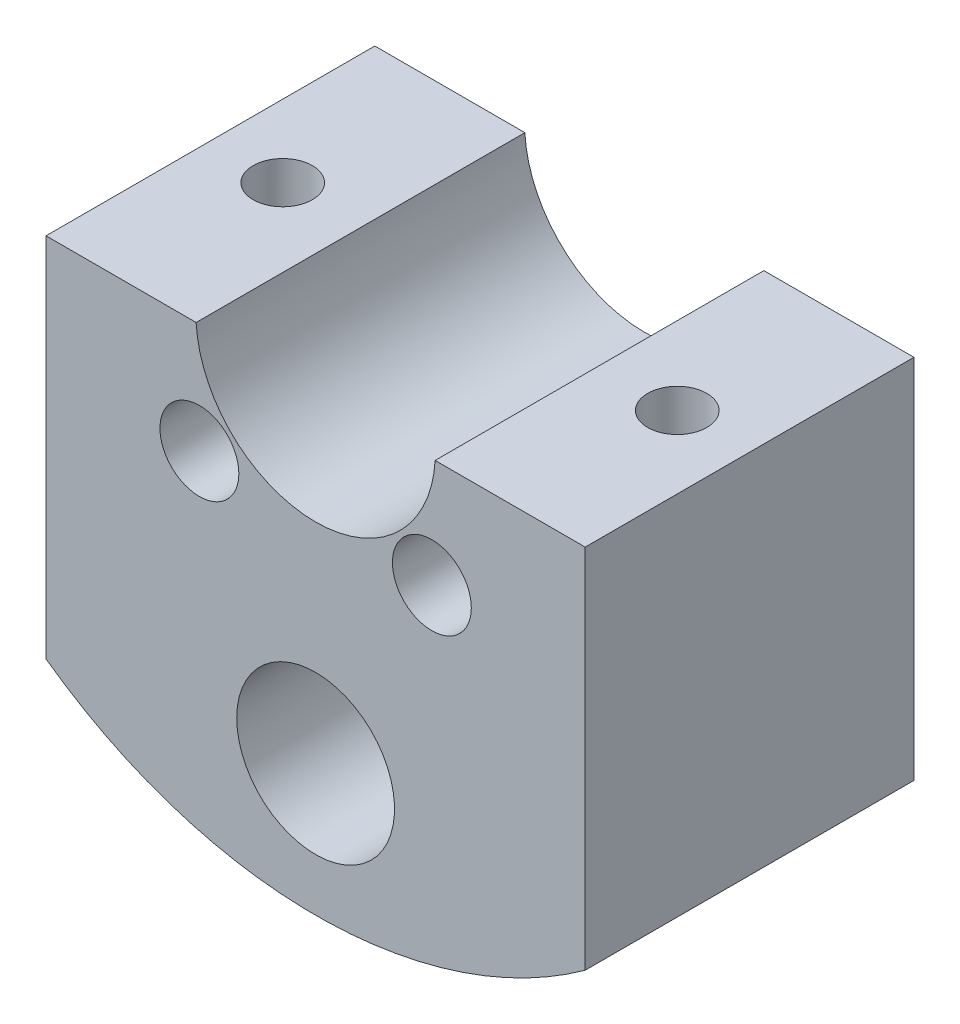
ISO-10303-21;
HEADER;
FILE_DESCRIPTION(('STEP AP214'),'2;1');
FILE_NAME('part.step','',(''),(''),'','','');
FILE_SCHEMA(('AUTOMOTIVE_DESIGN { 1 0 10303 214 1 1 1 1 }'));
ENDSEC;
DATA;
#1=APPLICATION_CONTEXT('core data for automotive mechanical design processes');
#2=APPLICATION_PROTOCOL_DEFINITION('international standard','automotive_design',2000,#1);
#3=PRODUCT_CONTEXT('',#1,'mechanical');
#4=PRODUCT('Part','Part','',(#3));
#5=PRODUCT_RELATED_PRODUCT_CATEGORY('part','',(#4));
#6=PRODUCT_DEFINITION_FORMATION('','',#4);
#7=PRODUCT_DEFINITION_CONTEXT('part definition',#1,'design');
#8=PRODUCT_DEFINITION('design','',#6,#7);
#9=PRODUCT_DEFINITION_SHAPE('','',#8);
#10=(LENGTH_UNIT() NAMED_UNIT(*) SI_UNIT(.MILLI.,.METRE.));
#11=(NAMED_UNIT(*) PLANE_ANGLE_UNIT() SI_UNIT($,.RADIAN.));
#12=(NAMED_UNIT(*) SI_UNIT($,.STERADIAN.) SOLID_ANGLE_UNIT());
#13=UNCERTAINTY_MEASURE_WITH_UNIT(LENGTH_MEASURE(1.E-05),#10,'distance_accuracy_value','');
#14=(GEOMETRIC_REPRESENTATION_CONTEXT(3) GLOBAL_UNCERTAINTY_ASSIGNED_CONTEXT((#13)) GLOBAL_UNIT_ASSIGNED_CONTEXT((#10,
#11,#12)) REPRESENTATION_CONTEXT('',''));
#15=CARTESIAN_POINT('',(0.,0.,0.));
#16=DIRECTION('',(0.,0.,1.));
#17=DIRECTION('',(1.,0.,0.));
#18=AXIS2_PLACEMENT_3D('',#15,#16,#17);
#19=CARTESIAN_POINT('',(0.,0.,-5.));
#20=DIRECTION('',(0.,0.,1.));
#21=DIRECTION('',(-1.,0.,0.));
#22=AXIS2_PLACEMENT_3D('',#19,#20,#21);
#23=CYLINDRICAL_SURFACE('',#22,35.);
#24=CARTESIAN_POINT('',(-15.,-31.6227766016838,-22.5));
#25=CARTESIAN_POINT('',(-14.7108595892664,-31.7599250587008,-22.499984811224));
#26=CARTESIAN_POINT('',(-14.4197303799188,-31.8931117339959,-22.4748546724919));
#27=CARTESIAN_POINT('',(-13.986388899209,-32.0843593115852,-22.3983865453481));
#28=CARTESIAN_POINT('',(-13.8424412778676,-32.1467105918036,-22.3664136376734));
#29=CARTESIAN_POINT('',(-13.5567255642703,-32.2682384217534,-22.289448152427));
#30=CARTESIAN_POINT('',(-13.4149566136927,-32.3274162458475,-22.2444608481555));
#31=CARTESIAN_POINT('',(-13.1341769045251,-32.4425112670565,-22.1412474885781));
#32=CARTESIAN_POINT('',(-12.9951803260907,-32.4984136353401,-22.0829663151793));
#33=CARTESIAN_POINT('',(-12.7218824991287,-32.606368674814,-21.9534294909495));
#34=CARTESIAN_POINT('',(-12.5875792807361,-32.6584229715763,-21.8821793632505));
#35=CARTESIAN_POINT('',(-12.3249178695441,-32.7584516548658,-21.7269619860706));
#36=CARTESIAN_POINT('',(-12.1965598959624,-32.8064258910043,-21.6429942681433));
#37=CARTESIAN_POINT('',(-11.9471326156375,-32.8980801333622,-21.4627853120111));
#38=CARTESIAN_POINT('',(-11.8260627732047,-32.9417604553412,-21.3665449774889));
#39=CARTESIAN_POINT('',(-11.6006146265409,-33.0217965909881,-21.1694715157018));
#40=CARTESIAN_POINT('',(-11.4956610263076,-33.058450061223,-21.0694166493023));
#41=CARTESIAN_POINT('',(-11.294247667538,-33.1278027540744,-20.859838964217));
#42=CARTESIAN_POINT('',(-11.1977872850142,-33.1605022672498,-20.7503168422538));
#43=CARTESIAN_POINT('',(-11.0143610271354,-33.2218784340844,-20.5225904653614));
#44=CARTESIAN_POINT('',(-10.927392577604,-33.2505561790362,-20.4043885789708));
#45=CARTESIAN_POINT('',(-10.7638261117773,-33.3038654003796,-20.1601557089798));
#46=CARTESIAN_POINT('',(-10.687227648019,-33.3284970513694,-20.0341250635316));
#47=CARTESIAN_POINT('',(-10.5495800038547,-33.3723126998023,-19.7831918141219));
#48=CARTESIAN_POINT('',(-10.4878642616025,-33.391738563085,-19.6586965043673));
#49=CARTESIAN_POINT('',(-10.3748379660337,-33.4270286791021,-19.404527513593));
#50=CARTESIAN_POINT('',(-10.3235308951628,-33.4428917400136,-19.2748521167742));
#51=CARTESIAN_POINT('',(-10.2318617945256,-33.4710517362687,-19.011390838132));
#52=CARTESIAN_POINT('',(-10.1914939636169,-33.4833505619883,-18.8776071770187));
#53=CARTESIAN_POINT('',(-10.1220391269036,-33.5044123009847,-18.6068160585478));
#54=CARTESIAN_POINT('',(-10.0929562235531,-33.5131739284166,-18.4698074479738));
#55=CARTESIAN_POINT('',(-10.0470791869999,-33.5269556526315,-18.1978604840948));
#56=CARTESIAN_POINT('',(-10.029938270536,-33.5320814197818,-18.0629858615904));
#57=CARTESIAN_POINT('',(-10.0066920008746,-33.5390259765502,-17.7921536903593));
#58=CARTESIAN_POINT('',(-10.000590637964,-33.5408435704182,-17.6561957678975));
#59=CARTESIAN_POINT('',(-9.99949132483136,-33.5411713190026,-17.3842919157108));
#60=CARTESIAN_POINT('',(-10.0044884445495,-33.5396829422649,-17.2483460074766));
#61=CARTESIAN_POINT('',(-10.0255348265424,-33.5333978559372,-16.9773387935651));
#62=CARTESIAN_POINT('',(-10.0415881582506,-33.5285999282076,-16.8422778320923));
#63=CARTESIAN_POINT('',(-10.0844113201471,-33.5157446883605,-16.5752825303259));
#64=CARTESIAN_POINT('',(-10.1110827483206,-33.5077172979149,-16.4433309495774));
#65=CARTESIAN_POINT('',(-10.1749159105263,-33.4883889950263,-16.1821842754555));
#66=CARTESIAN_POINT('',(-10.2120814589651,-33.4770868922506,-16.052990202782));
#67=CARTESIAN_POINT('',(-10.2965547390279,-33.4512019058107,-15.7983571994598));
#68=CARTESIAN_POINT('',(-10.3438584687287,-33.4366203165718,-15.6729168092928));
#69=CARTESIAN_POINT('',(-10.4482182273165,-33.4041572572084,-15.4265513765465));
#70=CARTESIAN_POINT('',(-10.5052778708487,-33.3862745638018,-15.3056280278749));
#71=CARTESIAN_POINT('',(-10.6290401372712,-33.3470799332417,-15.0683927870725));
#72=CARTESIAN_POINT('',(-10.6958017937957,-33.3257469050204,-14.9521151236066));
#73=CARTESIAN_POINT('',(-10.8381030296388,-33.2797404294552,-14.7257393988621));
#74=CARTESIAN_POINT('',(-10.9136457986032,-33.2550657677579,-14.6156436047529));
#75=CARTESIAN_POINT('',(-11.1524520511809,-33.1760586279396,-14.2957847427576));
#76=CARTESIAN_POINT('',(-11.3280167878193,-33.116704680168,-14.0962155282373));
#77=CARTESIAN_POINT('',(-11.7105189390787,-32.9834155351737,-13.7247828533645));
#78=CARTESIAN_POINT('',(-11.9181337060096,-32.9091514821212,-13.553741383818));
#79=CARTESIAN_POINT('',(-12.3545728361076,-32.7478033448639,-13.2488133037119));
#80=CARTESIAN_POINT('',(-12.5834012104489,-32.6607168342863,-13.114933739103));
#81=CARTESIAN_POINT('',(-13.0673439393278,-32.470223811483,-12.8803918838527));
#82=CARTESIAN_POINT('',(-13.323203109317,-32.3662129542649,-12.7817627001503));
#83=CARTESIAN_POINT('',(-13.8431629325489,-32.1472628173505,-12.6281111983818));
#84=CARTESIAN_POINT('',(-14.1072662305287,-32.032320005941,-12.5731030266238));
#85=CARTESIAN_POINT('',(-14.6574033805221,-31.7845607323878,-12.5034711329647));
#86=CARTESIAN_POINT('',(-14.9435584954624,-31.6510494818391,-12.492287118723));
#87=CARTESIAN_POINT('',(-15.5103554856421,-31.377191199284,-12.5180200845659));
#88=CARTESIAN_POINT('',(-15.790995306965,-31.236841685929,-12.5549546521008));
#89=CARTESIAN_POINT('',(-16.3632492291328,-30.9411703917865,-12.679813041512));
#90=CARTESIAN_POINT('',(-16.6538622923551,-30.7855677989587,-12.7716873989773));
#91=CARTESIAN_POINT('',(-17.2144689482389,-30.4756445573056,-13.0068152353263));
#92=CARTESIAN_POINT('',(-17.4844464739452,-30.3213249891094,-13.1501082646079));
#93=CARTESIAN_POINT('',(-18.00603724824,-30.0146150361425,-13.4919795950409));
#94=CARTESIAN_POINT('',(-18.2566572339337,-29.8624879935401,-13.6923412502661));
#95=CARTESIAN_POINT('',(-18.6034784592565,-29.6467424568674,-14.0299858045744));
#96=CARTESIAN_POINT('',(-18.7142297294925,-29.5769043231927,-14.1487114663299));
#97=CARTESIAN_POINT('',(-18.9249045415046,-29.4425464652469,-14.3981011366944));
#98=CARTESIAN_POINT('',(-19.0248320837519,-29.3780247781309,-14.5287607013709));
#99=CARTESIAN_POINT('',(-19.2593503173583,-29.2250850384744,-14.8695420145419));
#100=CARTESIAN_POINT('',(-19.3864560549578,-29.140746309588,-15.0868593419391));
#101=CARTESIAN_POINT('',(-19.5527849895133,-29.0291764144191,-15.4291767904157));
#102=CARTESIAN_POINT('',(-19.6041797544136,-28.9944714751552,-15.5460276425753));
#103=CARTESIAN_POINT('',(-19.6982891200437,-28.9306175656216,-15.7846300642926));
#104=CARTESIAN_POINT('',(-19.7410073758786,-28.9014662561272,-15.9063795442273));
#105=CARTESIAN_POINT('',(-19.8174430886722,-28.8491094730183,-16.154908893535));
#106=CARTESIAN_POINT('',(-19.8510942953168,-28.8259478109342,-16.2817184069379));
#107=CARTESIAN_POINT('',(-19.9084521413718,-28.7863639562259,-16.5385445999319));
#108=CARTESIAN_POINT('',(-19.9321635760734,-28.7699385138983,-16.6685597009069));
#109=CARTESIAN_POINT('',(-19.9692505346826,-28.74420889316,-16.930726692345));
#110=CARTESIAN_POINT('',(-19.9826283938082,-28.734903105829,-17.0628780931439));
#111=CARTESIAN_POINT('',(-19.9988110068962,-28.7236428508512,-17.32813299802));
#112=CARTESIAN_POINT('',(-20.0016168666901,-28.7216876143366,-17.4612364010584));
#113=CARTESIAN_POINT('',(-19.9968864533893,-28.7249809914716,-17.7123925874224));
#114=CARTESIAN_POINT('',(-19.9904618473523,-28.729455279284,-17.8304786117528));
#115=CARTESIAN_POINT('',(-19.9693111287247,-28.7441607867506,-18.0655806867782));
#116=CARTESIAN_POINT('',(-19.9545823853949,-28.7543938307689,-18.182596386452));
#117=CARTESIAN_POINT('',(-19.9170338584635,-28.7804149210048,-18.4146489733892));
#118=CARTESIAN_POINT('',(-19.8942171861303,-28.7962008311254,-18.5296866037603));
#119=CARTESIAN_POINT('',(-19.8408029031573,-28.833029412753,-18.7570980120819));
#120=CARTESIAN_POINT('',(-19.8102022757764,-28.8540741222987,-18.8694707387238));
#121=CARTESIAN_POINT('',(-19.7073599848066,-28.9245035378501,-19.2012346776944));
#122=CARTESIAN_POINT('',(-19.623997951619,-28.9812397453018,-19.4157541239855));
#123=CARTESIAN_POINT('',(-19.4312067404216,-29.1108508216109,-19.8272716933754));
#124=CARTESIAN_POINT('',(-19.3217687289665,-29.1837311588313,-20.0242638478387));
#125=CARTESIAN_POINT('',(-19.0652605804783,-29.3520381595449,-20.4216982278206));
#126=CARTESIAN_POINT('',(-18.9151966349943,-29.4491442581732,-20.6194947719187));
#127=CARTESIAN_POINT('',(-18.5911882369895,-29.6547565765892,-20.9876366986523));
#128=CARTESIAN_POINT('',(-18.417229748858,-29.7632694878595,-21.1579658181783));
#129=CARTESIAN_POINT('',(-18.0188583209708,-30.0063943911152,-21.4956843205912));
#130=CARTESIAN_POINT('',(-17.790863483636,-30.1423487285641,-21.6578925964998));
#131=CARTESIAN_POINT('',(-17.3133372424291,-30.4191496971216,-21.9413594092657));
#132=CARTESIAN_POINT('',(-17.0637920191619,-30.5599994323419,-22.0625914211809));
#133=CARTESIAN_POINT('',(-16.5201972482598,-30.857560291641,-22.2731416567471));
#134=CARTESIAN_POINT('',(-16.2242602879585,-31.0143288074209,-22.3575485366601));
#135=CARTESIAN_POINT('',(-15.6196477130294,-31.3231841620144,-22.4709815311788));
#136=CARTESIAN_POINT('',(-15.3109741050236,-31.4752717317556,-22.5000163357174));
#137=CARTESIAN_POINT('',(-15.,-31.6227766016838,-22.5));
#138=B_SPLINE_CURVE_WITH_KNOTS('',3,(#24,#25,#26,#27,#28,#29,#30,#31,#32,#33,#34,#35,#36,#37,
#38,#39,#40,#41,#42,#43,#44,#45,#46,#47,#48,#49,#50,#51,#52,#53,#54,#55,#56,#57,#58,#59,#60,#61,
#62,#63,#64,#65,#66,#67,#68,#69,#70,#71,#72,#73,#74,#75,#76,#77,#78,#79,#80,#81,#82,#83,#84,#85,
#86,#87,#88,#89,#90,#91,#92,#93,#94,#95,#96,#97,#98,#99,#100,#101,#102,#103,#104,#105,#106,#107,
#108,#109,#110,#111,#112,#113,#114,#115,#116,#117,#118,#119,#120,#121,#122,#123,#124,#125,#126,
#127,#128,#129,#130,#131,#132,#133,#134,#135,#136,#137),.UNSPECIFIED.,.T.,.F.,(4,2,2,2,2,2,2,2,
2,2,2,2,2,2,2,2,2,2,2,2,2,2,2,2,2,2,2,2,2,2,2,2,2,2,2,2,2,2,2,2,2,2,2,2,2,2,2,2,2,2,2,2,2,2,2,2,
4),(0.,0.958823560919178,1.4386347077036,1.91825171157577,2.39989462810997,2.88133290364455,
3.36278891703969,3.84420949931451,4.29232708579772,4.74041172205188,5.18837453590367,
5.63631801407596,6.05671330025165,6.4772490076256,6.89756126410556,7.31802617552204,
7.72570568014779,8.13353251260044,8.54117822042765,8.94897404967555,9.35307551458962,
9.75732405195256,10.1614133100848,10.5656526122914,10.9724634351946,11.3794224923068,
12.1925468222335,13.026098800941,13.8598087145221,14.7358741983093,15.6122236743538,
16.5561231142453,17.5003676483218,18.5224136816916,19.545247547177,20.6044217643881,
21.1339610292069,21.6633039025805,22.4559717985311,22.8524418707848,23.2487445762743,
23.6478689178376,24.0468004857378,24.445641875273,24.8444415448256,25.1990457895104,
25.5537624355043,25.9083427767428,26.26306074868,26.9710372368008,27.6792538994311,
28.4759812188399,29.2731785518602,30.2027042294683,31.1328304646455,32.1642189966005,
33.1954456521061),.UNSPECIFIED.);
#139=CARTESIAN_POINT('',(-15.,-31.6227766016838,-22.5));
#140=VERTEX_POINT('',#139);
#141=EDGE_CURVE('E154',#140,#140,#138,.T.);
#142=ORIENTED_EDGE('',*,*,#141,.F.);
#143=EDGE_LOOP('',(#142));
#144=FACE_BOUND('',#143,.T.);
#145=CARTESIAN_POINT('',(15.,-31.6227766016838,-22.5));
#146=CARTESIAN_POINT('',(15.3160346320635,-31.4728605114302,-22.4999921433626));
#147=CARTESIAN_POINT('',(15.6299642441852,-31.3180933974734,-22.4699915200063));
#148=CARTESIAN_POINT('',(16.2446995263359,-31.0036990224549,-22.352718708789));
#149=CARTESIAN_POINT('',(16.5454878926237,-30.8440657969392,-22.265373300452));
#150=CARTESIAN_POINT('',(17.1257267724918,-30.5257093614559,-22.0363568002947));
#151=CARTESIAN_POINT('',(17.405195857583,-30.3669854734745,-21.8947336537504));
#152=CARTESIAN_POINT('',(17.9359397810427,-30.0565540760589,-21.5593937418954));
#153=CARTESIAN_POINT('',(18.1872071428474,-29.9048484334695,-21.3656632084027));
#154=CARTESIAN_POINT('',(18.535252335494,-29.6894431278183,-21.039356105521));
#155=CARTESIAN_POINT('',(18.6460517929391,-29.6199340773473,-20.925189182252));
#156=CARTESIAN_POINT('',(18.8574645782712,-29.4857869644415,-20.6851997705102));
#157=CARTESIAN_POINT('',(18.958083713711,-29.4211461302852,-20.5593840066897));
#158=CARTESIAN_POINT('',(19.1477644015224,-29.2980529393159,-20.2968286226334));
#159=CARTESIAN_POINT('',(19.2368429851342,-29.2395914871651,-20.1601055922187));
#160=CARTESIAN_POINT('',(19.4022464654629,-29.1300989902873,-19.8763746758615));
#161=CARTESIAN_POINT('',(19.4785771136868,-29.0790645960261,-19.7293714707458));
#162=CARTESIAN_POINT('',(19.5968993364836,-28.9993972356659,-19.4703992516028));
#163=CARTESIAN_POINT('',(19.6424165953208,-28.9685694356076,-19.3606998254611));
#164=CARTESIAN_POINT('',(19.7258542584293,-28.9118180025274,-19.1372283062899));
#165=CARTESIAN_POINT('',(19.7637764296506,-28.8858932289252,-19.0234571677955));
#166=CARTESIAN_POINT('',(19.8315504692208,-28.8394052789698,-18.7925154364205));
#167=CARTESIAN_POINT('',(19.861405755287,-28.8188398321489,-18.6753463065476));
#168=CARTESIAN_POINT('',(19.9126522544775,-28.7834544749292,-18.4383684392625));
#169=CARTESIAN_POINT('',(19.9340472949127,-28.7686319665571,-18.3185609213804));
#170=CARTESIAN_POINT('',(19.9681485355146,-28.7449731015913,-18.0766157630205));
#171=CARTESIAN_POINT('',(19.9808184441522,-28.7361617493529,-17.954470536381));
#172=CARTESIAN_POINT('',(19.9971254716633,-28.72481631639,-17.7093330606528));
#173=CARTESIAN_POINT('',(20.0007660436978,-28.7222798359172,-17.586341153418));
#174=CARTESIAN_POINT('',(19.9989658325885,-28.7235333259239,-17.3404304164343));
#175=CARTESIAN_POINT('',(19.9935231274248,-28.7273246353625,-17.2175116076589));
#176=CARTESIAN_POINT('',(19.9736403337721,-28.7411523313146,-16.9727646507462));
#177=CARTESIAN_POINT('',(19.9592005134038,-28.7511885317257,-16.8509364702171));
#178=CARTESIAN_POINT('',(19.9226335514545,-28.7765379455227,-16.6162864089735));
#179=CARTESIAN_POINT('',(19.9009987038415,-28.7915128069527,-16.5033508238312));
#180=CARTESIAN_POINT('',(19.8502236209388,-28.8265427284768,-16.2799707634934));
#181=CARTESIAN_POINT('',(19.8210809453003,-28.8465994403433,-16.1695271109955));
#182=CARTESIAN_POINT('',(19.7229024035401,-28.9138974874446,-15.8429684651049));
#183=CARTESIAN_POINT('',(19.6430873674838,-28.9682868783713,-15.6314461002687));
#184=CARTESIAN_POINT('',(19.4518950958289,-29.0970417608564,-15.2114479827045));
#185=CARTESIAN_POINT('',(19.3387655001624,-29.1724990541075,-15.0041198453968));
#186=CARTESIAN_POINT('',(19.0877025259282,-29.3373851966789,-14.6112133460633));
#187=CARTESIAN_POINT('',(18.9497573066451,-29.4268207129904,-14.4256454370046));
#188=CARTESIAN_POINT('',(18.6296848379418,-29.6306618828552,-14.0510637273559));
#189=CARTESIAN_POINT('',(18.4440226135341,-29.7467873209153,-13.8660106372043));
#190=CARTESIAN_POINT('',(18.0495949656077,-29.9877577604641,-13.5291927962467));
#191=CARTESIAN_POINT('',(17.8408150703399,-30.1126082055974,-13.3774490765045));
#192=CARTESIAN_POINT('',(17.3710397390021,-30.38637319135,-13.0880260832994));
#193=CARTESIAN_POINT('',(17.1069471210647,-30.5360415206536,-12.956073860971));
#194=CARTESIAN_POINT('',(16.5598528251669,-30.8361556148533,-12.7404548458885));
#195=CARTESIAN_POINT('',(16.2768420113367,-30.9866017225183,-12.6568115729376));
#196=CARTESIAN_POINT('',(15.8332893160742,-31.214377918589,-12.5673994944733));
#197=CARTESIAN_POINT('',(15.6769588413032,-31.2931931461313,-12.5435048545229));
#198=CARTESIAN_POINT('',(15.3618903804152,-31.4490560887426,-12.5106019068862));
#199=CARTESIAN_POINT('',(15.2031533163359,-31.5261044536756,-12.5015880364586));
#200=CARTESIAN_POINT('',(14.8843593739559,-31.677863619,-12.4987948928915));
#201=CARTESIAN_POINT('',(14.7243020113044,-31.7525735085068,-12.5050214832399));
#202=CARTESIAN_POINT('',(14.404269438111,-31.8990276130301,-12.5330202607973));
#203=CARTESIAN_POINT('',(14.2442942262512,-31.9707732826341,-12.5547847251401));
#204=CARTESIAN_POINT('',(13.9313747000151,-32.1083318748133,-12.6130309406231));
#205=CARTESIAN_POINT('',(13.7783815373237,-32.174264821564,-12.648966055426));
#206=CARTESIAN_POINT('',(13.4751268102416,-32.3024463442413,-12.7355888892389));
#207=CARTESIAN_POINT('',(13.324863989514,-32.364696646052,-12.7862696306865));
#208=CARTESIAN_POINT('',(13.0284829521194,-32.4851383963955,-12.9023437109296));
#209=CARTESIAN_POINT('',(12.8823638263913,-32.5433307393322,-12.9677337941661));
#210=CARTESIAN_POINT('',(12.5957695221668,-32.6553250832706,-13.1130329434982));
#211=CARTESIAN_POINT('',(12.4552938053348,-32.7091275035427,-13.1929406206975));
#212=CARTESIAN_POINT('',(12.1935526935685,-32.807546158643,-13.3592574725376));
#213=CARTESIAN_POINT('',(12.0716823341891,-32.8525542416403,-13.4444843686871));
#214=CARTESIAN_POINT('',(11.8351549137766,-32.9385023907243,-13.6262427971682));
#215=CARTESIAN_POINT('',(11.7204971488156,-32.9794428540253,-13.7227732236692));
#216=CARTESIAN_POINT('',(11.4996131699126,-33.0571112430292,-13.9265060010814));
#217=CARTESIAN_POINT('',(11.3933840505678,-33.093840622277,-14.0337046456197));
#218=CARTESIAN_POINT('',(11.1904570640179,-33.1630089897625,-14.2580476407978));
#219=CARTESIAN_POINT('',(11.0937586435613,-33.195448227078,-14.375191413393));
#220=CARTESIAN_POINT('',(10.9179341719216,-33.2536708976301,-14.6092386032238));
#221=CARTESIAN_POINT('',(10.83803047559,-33.2797732095941,-14.7254794991465));
#222=CARTESIAN_POINT('',(10.6880071964241,-33.3282571031828,-14.9649101135982));
#223=CARTESIAN_POINT('',(10.6178908724067,-33.350637446008,-15.0881021275001));
#224=CARTESIAN_POINT('',(10.488201740105,-33.3916494104125,-15.34041984142));
#225=CARTESIAN_POINT('',(10.4286227428156,-33.4102832333627,-15.4695420018998));
#226=CARTESIAN_POINT('',(10.3205254920732,-33.4438329266287,-15.7328611762288));
#227=CARTESIAN_POINT('',(10.2720112202553,-33.4587474587396,-15.8670599967221));
#228=CARTESIAN_POINT('',(10.1883788872278,-33.4843062531339,-16.1336267469185));
#229=CARTESIAN_POINT('',(10.1527775067748,-33.4951055836105,-16.2658284254309));
#230=CARTESIAN_POINT('',(10.0924926527336,-33.5133195297501,-16.5329796836483));
#231=CARTESIAN_POINT('',(10.0678131076169,-33.5207329275589,-16.6679302338672));
#232=CARTESIAN_POINT('',(10.0296271032176,-33.5321782480619,-16.9394787903691));
#233=CARTESIAN_POINT('',(10.0161153285278,-33.5362117794485,-17.0760759814708));
#234=CARTESIAN_POINT('',(10.0003661011661,-33.5409115278194,-17.3500277225665));
#235=CARTESIAN_POINT('',(9.99813278391644,-33.5415765096726,-17.4873825318759));
#236=CARTESIAN_POINT('',(10.00491488903,-33.5395540997386,-17.7594967419769));
#237=CARTESIAN_POINT('',(10.0137435052187,-33.5369223804958,-17.8942612547691));
#238=CARTESIAN_POINT('',(10.04225920095,-33.5283947025729,-18.1625820745008));
#239=CARTESIAN_POINT('',(10.0619502237505,-33.5224975584793,-18.2961379247668));
#240=CARTESIAN_POINT('',(10.1120088083943,-33.5074314068863,-18.5609885926653));
#241=CARTESIAN_POINT('',(10.1423719735174,-33.4982637467543,-18.6922843180953));
#242=CARTESIAN_POINT('',(10.2135183558405,-33.4766399777062,-18.9517937188391));
#243=CARTESIAN_POINT('',(10.2543054251202,-33.4641826530612,-19.08000623557));
#244=CARTESIAN_POINT('',(10.3459462618444,-33.4359640615259,-19.332431551357));
#245=CARTESIAN_POINT('',(10.3968011675474,-33.4202024210413,-19.4566438963101));
#246=CARTESIAN_POINT('',(10.5081186176487,-33.3853686698047,-19.7002198144318));
#247=CARTESIAN_POINT('',(10.5685846562282,-33.366295354841,-19.8195816042602));
#248=CARTESIAN_POINT('',(10.7636062849936,-33.3041051400772,-20.1690732832317));
#249=CARTESIAN_POINT('',(10.9118826302595,-33.2559886971585,-20.3908753076352));
#250=CARTESIAN_POINT('',(11.2424449752489,-33.1457113792077,-20.809564009077));
#251=CARTESIAN_POINT('',(11.4252564604498,-33.083329861992,-21.0059739900642));
#252=CARTESIAN_POINT('',(11.8170880133243,-32.9454019399703,-21.3651922530931));
#253=CARTESIAN_POINT('',(12.0261144240895,-32.8698523472221,-21.5279923774162));
#254=CARTESIAN_POINT('',(12.472372263184,-32.703192647033,-21.8226639572682));
#255=CARTESIAN_POINT('',(12.7103932525023,-32.6115844641463,-21.9530537253149));
#256=CARTESIAN_POINT('',(13.2000545980374,-32.4164763424563,-22.1724908189194));
#257=CARTESIAN_POINT('',(13.4516914081322,-32.3129794921428,-22.2615488516499));
#258=CARTESIAN_POINT('',(13.9198768312852,-32.1137173462331,-22.3869325623157));
#259=CARTESIAN_POINT('',(14.1354298381515,-32.019457802726,-22.4295021111041));
#260=CARTESIAN_POINT('',(14.567648592815,-31.8251448557232,-22.4860409629471));
#261=CARTESIAN_POINT('',(14.7843145250295,-31.7250904617849,-22.5000053619521));
#262=CARTESIAN_POINT('',(15.,-31.6227766016838,-22.5));
#263=B_SPLINE_CURVE_WITH_KNOTS('',3,(#145,#146,#147,#148,#149,#150,#151,#152,#153,#154,#155,
#156,#157,#158,#159,#160,#161,#162,#163,#164,#165,#166,#167,#168,#169,#170,#171,#172,#173,#174,
#175,#176,#177,#178,#179,#180,#181,#182,#183,#184,#185,#186,#187,#188,#189,#190,#191,#192,#193,
#194,#195,#196,#197,#198,#199,#200,#201,#202,#203,#204,#205,#206,#207,#208,#209,#210,#211,#212,
#213,#214,#215,#216,#217,#218,#219,#220,#221,#222,#223,#224,#225,#226,#227,#228,#229,#230,#231,
#232,#233,#234,#235,#236,#237,#238,#239,#240,#241,#242,#243,#244,#245,#246,#247,#248,#249,#250,
#251,#252,#253,#254,#255,#256,#257,#258,#259,#260,#261,#262),.UNSPECIFIED.,.T.,.F.,(4,2,2,2,2,2,
2,2,2,2,2,2,2,2,2,2,2,2,2,2,2,2,2,2,2,2,2,2,2,2,2,2,2,2,2,2,2,2,2,2,2,2,2,2,2,2,2,2,2,2,2,2,2,2,
2,2,2,2,4),(0.,1.04848209480661,2.09830555057026,3.14720379285871,4.19637945517946,
4.71660956757033,5.23654121164986,5.75569659530456,6.27461711427302,6.64236594252154,
7.01002911665586,7.37753627690077,7.74487699070786,8.11373654887135,8.48245501937511,
8.85125152053658,9.22003703181991,9.56751755356233,9.91511116339034,10.609755486684,
11.350807335315,12.0922137174679,12.9490380735494,13.8064018701641,14.7952682808886,
15.7846157283681,16.3141596422508,16.8435055567392,17.3730551593785,17.9023417404484,
18.4129446474464,18.9233063313822,19.4335551699856,19.9437552188311,20.4092728192305,
20.8747449157774,21.3400558579554,21.8053397731763,22.2351519366021,22.6651068712429,
23.0948084309303,23.5246643753572,23.9361767749192,24.3478370711847,24.7593013207836,
25.1709164292166,25.5756732180041,25.9805770379043,26.3853142402585,26.7902012271845,
27.1951340163613,27.6002143592674,28.409531858924,29.2323336896449,30.0553349950292,
30.9109574886608,31.7663582055266,32.4817975145617,33.1973594678191),.UNSPECIFIED.);
#264=CARTESIAN_POINT('',(15.,-31.6227766016838,-22.5));
#265=VERTEX_POINT('',#264);
#266=EDGE_CURVE('E149',#265,#265,#263,.T.);
#267=ORIENTED_EDGE('',*,*,#266,.F.);
#268=EDGE_LOOP('',(#267));
#269=FACE_BOUND('',#268,.T.);
#270=DIRECTION('',(0.,0.,1.));
#271=VECTOR('',#270,1.);
#272=CARTESIAN_POINT('',(-20.5,-28.3681159050086,-30.));
#273=LINE('',#272,#271);
#274=CARTESIAN_POINT('',(-20.5,-28.3681159050086,-30.));
#275=VERTEX_POINT('',#274);
#276=CARTESIAN_POINT('',(-20.5,-28.3681159050086,-5.00000000000001));
#277=VERTEX_POINT('',#276);
#278=EDGE_CURVE('E94',#275,#277,#273,.T.);
#279=ORIENTED_EDGE('',*,*,#278,.F.);
#280=CARTESIAN_POINT('',(0.,0.,-30.));
#281=DIRECTION('',(0.,0.,1.));
#282=DIRECTION('',(1.,0.,0.));
#283=AXIS2_PLACEMENT_3D('',#280,#281,#282);
#284=CIRCLE('',#283,35.);
#285=CARTESIAN_POINT('',(20.5,-28.3681159050086,-30.));
#286=VERTEX_POINT('',#285);
#287=EDGE_CURVE('E102',#275,#286,#284,.T.);
#288=ORIENTED_EDGE('',*,*,#287,.T.);
#289=DIRECTION('',(0.,0.,1.));
#290=VECTOR('',#289,1.);
#291=CARTESIAN_POINT('',(20.5,-28.3681159050086,-30.));
#292=LINE('',#291,#290);
#293=CARTESIAN_POINT('',(20.5,-28.3681159050086,-5.));
#294=VERTEX_POINT('',#293);
#295=EDGE_CURVE('E363',#286,#294,#292,.T.);
#296=ORIENTED_EDGE('',*,*,#295,.T.);
#297=CARTESIAN_POINT('',(0.,0.,-5.));
#298=DIRECTION('',(0.,0.,1.));
#299=DIRECTION('',(1.,0.,0.));
#300=AXIS2_PLACEMENT_3D('',#297,#298,#299);
#301=CIRCLE('',#300,35.);
#302=EDGE_CURVE('E113',#277,#294,#301,.T.);
#303=ORIENTED_EDGE('',*,*,#302,.F.);
#304=EDGE_LOOP('',(#279,#288,#296,#303));
#305=FACE_BOUND('',#304,.T.);
#306=ADVANCED_FACE('F37',(#144,#269,#305),#23,.T.);
#307=CARTESIAN_POINT('',(15.,-35.,-17.5));
#308=DIRECTION('',(0.,1.,0.));
#309=DIRECTION('',(0.,0.,-1.));
#310=AXIS2_PLACEMENT_3D('',#307,#308,#309);
#311=CYLINDRICAL_SURFACE('',#310,2.25);
#312=CARTESIAN_POINT('',(15.,-25.,-17.5));
#313=DIRECTION('',(0.,1.,0.));
#314=DIRECTION('',(0.,0.,1.));
#315=AXIS2_PLACEMENT_3D('',#312,#313,#314);
#316=CIRCLE('',#315,2.25);
#317=CARTESIAN_POINT('',(15.,-25.,-15.25));
#318=VERTEX_POINT('',#317);
#319=EDGE_CURVE('E144',#318,#318,#316,.F.);
#320=ORIENTED_EDGE('',*,*,#319,.T.);
#321=EDGE_LOOP('',(#320));
#322=FACE_BOUND('',#321,.T.);
#323=CARTESIAN_POINT('',(15.,-0.5,-17.5));
#324=DIRECTION('',(0.,-1.,0.));
#325=DIRECTION('',(0.,0.,-1.));
#326=AXIS2_PLACEMENT_3D('',#323,#324,#325);
#327=CIRCLE('',#326,2.25);
#328=CARTESIAN_POINT('',(15.,-0.5,-19.75));
#329=VERTEX_POINT('',#328);
#330=EDGE_CURVE('E127',#329,#329,#327,.F.);
#331=ORIENTED_EDGE('',*,*,#330,.T.);
#332=EDGE_LOOP('',(#331));
#333=FACE_BOUND('',#332,.T.);
#334=ADVANCED_FACE('F177',(#322,#333),#311,.F.);
#335=CARTESIAN_POINT('',(-15.,-35.,-17.5));
#336=DIRECTION('',(0.,1.,0.));
#337=DIRECTION('',(0.,0.,-1.));
#338=AXIS2_PLACEMENT_3D('',#335,#336,#337);
#339=CYLINDRICAL_SURFACE('',#338,2.25);
#340=CARTESIAN_POINT('',(-15.,-25.,-17.5));
#341=DIRECTION('',(0.,1.,0.));
#342=DIRECTION('',(0.,0.,1.));
#343=AXIS2_PLACEMENT_3D('',#340,#341,#342);
#344=CIRCLE('',#343,2.25);
#345=CARTESIAN_POINT('',(-15.,-25.,-15.25));
#346=VERTEX_POINT('',#345);
#347=EDGE_CURVE('E148',#346,#346,#344,.F.);
#348=ORIENTED_EDGE('',*,*,#347,.T.);
#349=EDGE_LOOP('',(#348));
#350=FACE_BOUND('',#349,.T.);
#351=CARTESIAN_POINT('',(-15.,-0.5,-17.5));
#352=DIRECTION('',(0.,-1.,0.));
#353=DIRECTION('',(0.,0.,-1.));
#354=AXIS2_PLACEMENT_3D('',#351,#352,#353);
#355=CIRCLE('',#354,2.25);
#356=CARTESIAN_POINT('',(-15.,-0.5,-19.75));
#357=VERTEX_POINT('',#356);
#358=EDGE_CURVE('E124',#357,#357,#355,.F.);
#359=ORIENTED_EDGE('',*,*,#358,.T.);
#360=EDGE_LOOP('',(#359));
#361=FACE_BOUND('',#360,.T.);
#362=ADVANCED_FACE('F180',(#350,#361),#339,.F.);
#363=CARTESIAN_POINT('',(0.,0.,-30.));
#364=DIRECTION('',(0.,0.,-1.));
#365=DIRECTION('',(1.,0.,0.));
#366=AXIS2_PLACEMENT_3D('',#363,#364,#365);
#367=PLANE('',#366);
#368=CARTESIAN_POINT('',(0.,-25.,-30.));
#369=DIRECTION('',(0.,0.,1.));
#370=DIRECTION('',(1.,0.,0.));
#371=AXIS2_PLACEMENT_3D('',#368,#369,#370);
#372=CIRCLE('',#371,6.);
#373=CARTESIAN_POINT('',(-6.00000000000001,-25.,-30.));
#374=VERTEX_POINT('',#373);
#375=EDGE_CURVE('E138',#374,#374,#372,.T.);
#376=ORIENTED_EDGE('',*,*,#375,.T.);
#377=EDGE_LOOP('',(#376));
#378=FACE_BOUND('',#377,.T.);
#379=CARTESIAN_POINT('',(8.83883476483183,-8.83883476483185,-30.));
#380=DIRECTION('',(0.,0.,1.));
#381=DIRECTION('',(1.,0.,0.));
#382=AXIS2_PLACEMENT_3D('',#379,#380,#381);
#383=CIRCLE('',#382,3.);
#384=CARTESIAN_POINT('',(11.8388347648318,-8.83883476483185,-30.));
#385=VERTEX_POINT('',#384);
#386=EDGE_CURVE('E153',#385,#385,#383,.T.);
#387=ORIENTED_EDGE('',*,*,#386,.T.);
#388=EDGE_LOOP('',(#387));
#389=FACE_BOUND('',#388,.T.);
#390=CARTESIAN_POINT('',(-8.83883476483185,-8.83883476483184,-30.));
#391=DIRECTION('',(0.,0.,1.));
#392=DIRECTION('',(1.,0.,0.));
#393=AXIS2_PLACEMENT_3D('',#390,#391,#392);
#394=CIRCLE('',#393,3.);
#395=CARTESIAN_POINT('',(-5.83883476483185,-8.83883476483184,-30.));
#396=VERTEX_POINT('',#395);
#397=EDGE_CURVE('E150',#396,#396,#394,.T.);
#398=ORIENTED_EDGE('',*,*,#397,.T.);
#399=EDGE_LOOP('',(#398));
#400=FACE_BOUND('',#399,.T.);
#401=DIRECTION('',(1.,0.,0.));
#402=VECTOR('',#401,1.);
#403=CARTESIAN_POINT('',(-20.5,-0.5,-30.));
#404=LINE('',#403,#402);
#405=CARTESIAN_POINT('',(-20.5,-0.5,-30.));
#406=VERTEX_POINT('',#405);
#407=CARTESIAN_POINT('',(-9.08625335328044,-0.5,-30.));
#408=VERTEX_POINT('',#407);
#409=EDGE_CURVE('E357',#406,#408,#404,.T.);
#410=ORIENTED_EDGE('',*,*,#409,.T.);
#411=CARTESIAN_POINT('',(0.,0.,-30.));
#412=DIRECTION('',(0.,0.,1.));
#413=DIRECTION('',(1.,0.,0.));
#414=AXIS2_PLACEMENT_3D('',#411,#412,#413);
#415=CIRCLE('',#414,9.1);
#416=CARTESIAN_POINT('',(9.08625335328044,-0.5,-30.));
#417=VERTEX_POINT('',#416);
#418=EDGE_CURVE('E110',#408,#417,#415,.T.);
#419=ORIENTED_EDGE('',*,*,#418,.T.);
#420=CARTESIAN_POINT('',(20.5,-0.5,-30.));
#421=VERTEX_POINT('',#420);
#422=EDGE_CURVE('E99',#417,#421,#404,.T.);
#423=ORIENTED_EDGE('',*,*,#422,.T.);
#424=DIRECTION('',(0.,-1.,0.));
#425=VECTOR('',#424,1.);
#426=CARTESIAN_POINT('',(20.5,-0.5,-30.));
#427=LINE('',#426,#425);
#428=EDGE_CURVE('E106',#421,#286,#427,.T.);
#429=ORIENTED_EDGE('',*,*,#428,.T.);
#430=ORIENTED_EDGE('',*,*,#287,.F.);
#431=DIRECTION('',(0.,1.,0.));
#432=VECTOR('',#431,1.);
#433=CARTESIAN_POINT('',(-20.5,-28.3681159050086,-30.));
#434=LINE('',#433,#432);
#435=EDGE_CURVE('E89',#275,#406,#434,.T.);
#436=ORIENTED_EDGE('',*,*,#435,.T.);
#437=EDGE_LOOP('',(#410,#419,#423,#429,#430,#436));
#438=FACE_BOUND('',#437,.T.);
#439=ADVANCED_FACE('F103',(#378,#389,#400,#438),#367,.T.);
#440=CARTESIAN_POINT('',(0.,0.,-30.));
#441=DIRECTION('',(0.,0.,1.));
#442=DIRECTION('',(-1.,0.,0.));
#443=AXIS2_PLACEMENT_3D('',#440,#441,#442);
#444=CYLINDRICAL_SURFACE('',#443,9.1);
#445=ORIENTED_EDGE('',*,*,#418,.F.);
#446=DIRECTION('',(0.,0.,1.));
#447=VECTOR('',#446,1.);
#448=CARTESIAN_POINT('',(-9.08625335328044,-0.5,-30.));
#449=LINE('',#448,#447);
#450=CARTESIAN_POINT('',(-9.08625335328044,-0.5,-5.));
#451=VERTEX_POINT('',#450);
#452=EDGE_CURVE('E114',#451,#408,#449,.F.);
#453=ORIENTED_EDGE('',*,*,#452,.F.);
#454=CARTESIAN_POINT('',(0.,0.,-5.));
#455=DIRECTION('',(0.,0.,1.));
#456=DIRECTION('',(1.,0.,0.));
#457=AXIS2_PLACEMENT_3D('',#454,#455,#456);
#458=CIRCLE('',#457,9.1);
#459=CARTESIAN_POINT('',(9.08625335328044,-0.5,-5.));
#460=VERTEX_POINT('',#459);
#461=EDGE_CURVE('E109',#460,#451,#458,.F.);
#462=ORIENTED_EDGE('',*,*,#461,.F.);
#463=DIRECTION('',(0.,0.,1.));
#464=VECTOR('',#463,1.);
#465=CARTESIAN_POINT('',(9.08625335328044,-0.5,-30.));
#466=LINE('',#465,#464);
#467=EDGE_CURVE('E116',#417,#460,#466,.T.);
#468=ORIENTED_EDGE('',*,*,#467,.F.);
#469=EDGE_LOOP('',(#445,#453,#462,#468));
#470=FACE_BOUND('',#469,.T.);
#471=ADVANCED_FACE('F193',(#470),#444,.F.);
#472=CARTESIAN_POINT('',(-21.,-35.,-5.));
#473=DIRECTION('',(0.,0.,-1.));
#474=DIRECTION('',(1.,0.,0.));
#475=AXIS2_PLACEMENT_3D('',#472,#473,#474);
#476=PLANE('',#475);
#477=CARTESIAN_POINT('',(8.83883476483183,-8.83883476483185,-5.));
#478=DIRECTION('',(0.,0.,1.));
#479=DIRECTION('',(1.,0.,0.));
#480=AXIS2_PLACEMENT_3D('',#477,#478,#479);
#481=CIRCLE('',#480,3.);
#482=CARTESIAN_POINT('',(11.8388347648318,-8.83883476483185,-5.));
#483=VERTEX_POINT('',#482);
#484=EDGE_CURVE('E134',#483,#483,#481,.T.);
#485=ORIENTED_EDGE('',*,*,#484,.F.);
#486=EDGE_LOOP('',(#485));
#487=FACE_BOUND('',#486,.T.);
#488=CARTESIAN_POINT('',(-8.83883476483185,-8.83883476483184,-5.));
#489=DIRECTION('',(0.,0.,1.));
#490=DIRECTION('',(1.,0.,0.));
#491=AXIS2_PLACEMENT_3D('',#488,#489,#490);
#492=CIRCLE('',#491,3.);
#493=CARTESIAN_POINT('',(-5.83883476483185,-8.83883476483184,-5.));
#494=VERTEX_POINT('',#493);
#495=EDGE_CURVE('E131',#494,#494,#492,.T.);
#496=ORIENTED_EDGE('',*,*,#495,.F.);
#497=EDGE_LOOP('',(#496));
#498=FACE_BOUND('',#497,.T.);
#499=CARTESIAN_POINT('',(0.,-25.,-5.));
#500=DIRECTION('',(0.,0.,1.));
#501=DIRECTION('',(1.,0.,0.));
#502=AXIS2_PLACEMENT_3D('',#499,#500,#501);
#503=CIRCLE('',#502,6.);
#504=CARTESIAN_POINT('',(-6.00000000000001,-25.,-5.));
#505=VERTEX_POINT('',#504);
#506=EDGE_CURVE('E130',#505,#505,#503,.T.);
#507=ORIENTED_EDGE('',*,*,#506,.F.);
#508=EDGE_LOOP('',(#507));
#509=FACE_BOUND('',#508,.T.);
#510=DIRECTION('',(0.,-1.,0.));
#511=VECTOR('',#510,1.);
#512=CARTESIAN_POINT('',(-20.5,-35.,-5.));
#513=LINE('',#512,#511);
#514=CARTESIAN_POINT('',(-20.5,-0.5,-5.00000000000001));
#515=VERTEX_POINT('',#514);
#516=EDGE_CURVE('E11',#515,#277,#513,.T.);
#517=ORIENTED_EDGE('',*,*,#516,.T.);
#518=ORIENTED_EDGE('',*,*,#302,.T.);
#519=DIRECTION('',(0.,1.,0.));
#520=VECTOR('',#519,1.);
#521=CARTESIAN_POINT('',(20.5,-35.,-5.));
#522=LINE('',#521,#520);
#523=CARTESIAN_POINT('',(20.5,-0.5,-5.00000000000001));
#524=VERTEX_POINT('',#523);
#525=EDGE_CURVE('E52',#294,#524,#522,.T.);
#526=ORIENTED_EDGE('',*,*,#525,.T.);
#527=DIRECTION('',(-1.,0.,0.));
#528=VECTOR('',#527,1.);
#529=CARTESIAN_POINT('',(-21.,-0.5,-5.));
#530=LINE('',#529,#528);
#531=EDGE_CURVE('E362',#524,#460,#530,.T.);
#532=ORIENTED_EDGE('',*,*,#531,.T.);
#533=ORIENTED_EDGE('',*,*,#461,.T.);
#534=EDGE_CURVE('E45',#451,#515,#530,.T.);
#535=ORIENTED_EDGE('',*,*,#534,.T.);
#536=EDGE_LOOP('',(#517,#518,#526,#532,#533,#535));
#537=FACE_BOUND('',#536,.T.);
#538=ADVANCED_FACE('F191',(#487,#498,#509,#537),#476,.F.);
#539=CARTESIAN_POINT('',(8.83883476483183,-8.83883476483185,-30.));
#540=DIRECTION('',(0.,0.,1.));
#541=DIRECTION('',(-1.,0.,0.));
#542=AXIS2_PLACEMENT_3D('',#539,#540,#541);
#543=CYLINDRICAL_SURFACE('',#542,3.);
#544=ORIENTED_EDGE('',*,*,#386,.F.);
#545=EDGE_LOOP('',(#544));
#546=FACE_BOUND('',#545,.T.);
#547=ORIENTED_EDGE('',*,*,#484,.T.);
#548=EDGE_LOOP('',(#547));
#549=FACE_BOUND('',#548,.T.);
#550=ADVANCED_FACE('F187',(#546,#549),#543,.F.);
#551=CARTESIAN_POINT('',(-8.83883476483185,-8.83883476483184,-30.));
#552=DIRECTION('',(0.,0.,1.));
#553=DIRECTION('',(-1.,0.,0.));
#554=AXIS2_PLACEMENT_3D('',#551,#552,#553);
#555=CYLINDRICAL_SURFACE('',#554,3.);
#556=ORIENTED_EDGE('',*,*,#397,.F.);
#557=EDGE_LOOP('',(#556));
#558=FACE_BOUND('',#557,.T.);
#559=ORIENTED_EDGE('',*,*,#495,.T.);
#560=EDGE_LOOP('',(#559));
#561=FACE_BOUND('',#560,.T.);
#562=ADVANCED_FACE('F174',(#558,#561),#555,.F.);
#563=CARTESIAN_POINT('',(-15.,-35.,-17.5));
#564=DIRECTION('',(0.,1.,0.));
#565=DIRECTION('',(0.,0.,-1.));
#566=AXIS2_PLACEMENT_3D('',#563,#564,#565);
#567=CYLINDRICAL_SURFACE('',#566,5.);
#568=CARTESIAN_POINT('',(-15.,-25.,-17.5));
#569=DIRECTION('',(0.,-1.,0.));
#570=DIRECTION('',(0.,0.,-1.));
#571=AXIS2_PLACEMENT_3D('',#568,#569,#570);
#572=CIRCLE('',#571,5.);
#573=CARTESIAN_POINT('',(-15.,-25.,-22.5));
#574=VERTEX_POINT('',#573);
#575=EDGE_CURVE('E145',#574,#574,#572,.T.);
#576=ORIENTED_EDGE('',*,*,#575,.F.);
#577=EDGE_LOOP('',(#576));
#578=FACE_BOUND('',#577,.T.);
#579=ORIENTED_EDGE('',*,*,#141,.T.);
#580=EDGE_LOOP('',(#579));
#581=FACE_BOUND('',#580,.T.);
#582=ADVANCED_FACE('F168',(#578,#581),#567,.F.);
#583=CARTESIAN_POINT('',(-15.,-25.,-17.5));
#584=DIRECTION('',(0.,-1.,0.));
#585=DIRECTION('',(0.,0.,-1.));
#586=AXIS2_PLACEMENT_3D('',#583,#584,#585);
#587=PLANE('',#586);
#588=ORIENTED_EDGE('',*,*,#575,.T.);
#589=EDGE_LOOP('',(#588));
#590=FACE_BOUND('',#589,.T.);
#591=ORIENTED_EDGE('',*,*,#347,.F.);
#592=EDGE_LOOP('',(#591));
#593=FACE_BOUND('',#592,.T.);
#594=ADVANCED_FACE('F173',(#590,#593),#587,.T.);
#595=CARTESIAN_POINT('',(15.,-35.,-17.5));
#596=DIRECTION('',(0.,1.,0.));
#597=DIRECTION('',(0.,0.,-1.));
#598=AXIS2_PLACEMENT_3D('',#595,#596,#597);
#599=CYLINDRICAL_SURFACE('',#598,5.);
#600=CARTESIAN_POINT('',(15.,-25.,-17.5));
#601=DIRECTION('',(0.,-1.,0.));
#602=DIRECTION('',(0.,0.,-1.));
#603=AXIS2_PLACEMENT_3D('',#600,#601,#602);
#604=CIRCLE('',#603,5.);
#605=CARTESIAN_POINT('',(15.,-25.,-22.5));
#606=VERTEX_POINT('',#605);
#607=EDGE_CURVE('E141',#606,#606,#604,.T.);
#608=ORIENTED_EDGE('',*,*,#607,.F.);
#609=EDGE_LOOP('',(#608));
#610=FACE_BOUND('',#609,.T.);
#611=ORIENTED_EDGE('',*,*,#266,.T.);
#612=EDGE_LOOP('',(#611));
#613=FACE_BOUND('',#612,.T.);
#614=ADVANCED_FACE('F215',(#610,#613),#599,.F.);
#615=CARTESIAN_POINT('',(15.,-25.,-17.5));
#616=DIRECTION('',(0.,-1.,0.));
#617=DIRECTION('',(0.,0.,-1.));
#618=AXIS2_PLACEMENT_3D('',#615,#616,#617);
#619=PLANE('',#618);
#620=ORIENTED_EDGE('',*,*,#607,.T.);
#621=EDGE_LOOP('',(#620));
#622=FACE_BOUND('',#621,.T.);
#623=ORIENTED_EDGE('',*,*,#319,.F.);
#624=EDGE_LOOP('',(#623));
#625=FACE_BOUND('',#624,.T.);
#626=ADVANCED_FACE('F219',(#622,#625),#619,.T.);
#627=CARTESIAN_POINT('',(0.,-25.,-30.));
#628=DIRECTION('',(0.,0.,1.));
#629=DIRECTION('',(-1.,0.,0.));
#630=AXIS2_PLACEMENT_3D('',#627,#628,#629);
#631=CYLINDRICAL_SURFACE('',#630,6.);
#632=CARTESIAN_POINT('',(-6.00000000000001,-25.,-5.));
#633=CARTESIAN_POINT('',(-6.00000000000001,-25.,-5.26041666666667));
#634=CARTESIAN_POINT('',(-6.00000000000001,-25.,-5.52083333333334));
#635=CARTESIAN_POINT('',(-6.00000000000001,-25.,-6.04166666666667));
#636=CARTESIAN_POINT('',(-6.00000000000001,-25.,-6.30208333333334));
#637=CARTESIAN_POINT('',(-6.00000000000001,-25.,-6.82291666666667));
#638=CARTESIAN_POINT('',(-6.00000000000001,-25.,-7.08333333333334));
#639=CARTESIAN_POINT('',(-6.00000000000001,-25.,-7.60416666666667));
#640=CARTESIAN_POINT('',(-6.00000000000001,-25.,-7.86458333333334));
#641=CARTESIAN_POINT('',(-6.00000000000001,-25.,-8.38541666666667));
#642=CARTESIAN_POINT('',(-6.00000000000001,-25.,-8.64583333333334));
#643=CARTESIAN_POINT('',(-6.00000000000001,-25.,-9.16666666666667));
#644=CARTESIAN_POINT('',(-6.00000000000001,-25.,-9.42708333333334));
#645=CARTESIAN_POINT('',(-6.00000000000001,-25.,-9.94791666666667));
#646=CARTESIAN_POINT('',(-6.00000000000001,-25.,-10.2083333333333));
#647=CARTESIAN_POINT('',(-6.00000000000001,-25.,-10.7291666666667));
#648=CARTESIAN_POINT('',(-6.00000000000001,-25.,-10.9895833333333));
#649=CARTESIAN_POINT('',(-6.00000000000001,-25.,-11.5104166666667));
#650=CARTESIAN_POINT('',(-6.00000000000001,-25.,-11.7708333333333));
#651=CARTESIAN_POINT('',(-6.00000000000001,-25.,-12.2916666666667));
#652=CARTESIAN_POINT('',(-6.00000000000001,-25.,-12.5520833333333));
#653=CARTESIAN_POINT('',(-6.00000000000001,-25.,-13.0729166666667));
#654=CARTESIAN_POINT('',(-6.00000000000001,-25.,-13.3333333333333));
#655=CARTESIAN_POINT('',(-6.00000000000001,-25.,-13.8541666666667));
#656=CARTESIAN_POINT('',(-6.00000000000001,-25.,-14.1145833333333));
#657=CARTESIAN_POINT('',(-6.00000000000001,-25.,-14.6354166666667));
#658=CARTESIAN_POINT('',(-6.00000000000001,-25.,-14.8958333333333));
#659=CARTESIAN_POINT('',(-6.00000000000001,-25.,-15.4166666666667));
#660=CARTESIAN_POINT('',(-6.00000000000001,-25.,-15.6770833333333));
#661=CARTESIAN_POINT('',(-6.00000000000001,-25.,-16.1979166666667));
#662=CARTESIAN_POINT('',(-6.00000000000001,-25.,-16.4583333333333));
#663=CARTESIAN_POINT('',(-6.00000000000001,-25.,-16.9791666666667));
#664=CARTESIAN_POINT('',(-6.00000000000001,-25.,-17.2395833333333));
#665=CARTESIAN_POINT('',(-6.00000000000001,-25.,-17.7604166666667));
#666=CARTESIAN_POINT('',(-6.00000000000001,-25.,-18.0208333333333));
#667=CARTESIAN_POINT('',(-6.00000000000001,-25.,-18.5416666666667));
#668=CARTESIAN_POINT('',(-6.00000000000001,-25.,-18.8020833333333));
#669=CARTESIAN_POINT('',(-6.00000000000001,-25.,-19.3229166666667));
#670=CARTESIAN_POINT('',(-6.00000000000001,-25.,-19.5833333333333));
#671=CARTESIAN_POINT('',(-6.00000000000001,-25.,-20.1041666666667));
#672=CARTESIAN_POINT('',(-6.00000000000001,-25.,-20.3645833333333));
#673=CARTESIAN_POINT('',(-6.00000000000001,-25.,-20.8854166666667));
#674=CARTESIAN_POINT('',(-6.00000000000001,-25.,-21.1458333333333));
#675=CARTESIAN_POINT('',(-6.00000000000001,-25.,-21.6666666666667));
#676=CARTESIAN_POINT('',(-6.00000000000001,-25.,-21.9270833333333));
#677=CARTESIAN_POINT('',(-6.00000000000001,-25.,-22.4479166666667));
#678=CARTESIAN_POINT('',(-6.00000000000001,-25.,-22.7083333333333));
#679=CARTESIAN_POINT('',(-6.00000000000001,-25.,-23.2291666666667));
#680=CARTESIAN_POINT('',(-6.00000000000001,-25.,-23.4895833333333));
#681=CARTESIAN_POINT('',(-6.00000000000001,-25.,-24.0104166666667));
#682=CARTESIAN_POINT('',(-6.00000000000001,-25.,-24.2708333333333));
#683=CARTESIAN_POINT('',(-6.00000000000001,-25.,-24.7916666666667));
#684=CARTESIAN_POINT('',(-6.00000000000001,-25.,-25.0520833333333));
#685=CARTESIAN_POINT('',(-6.00000000000001,-25.,-25.5729166666667));
#686=CARTESIAN_POINT('',(-6.00000000000001,-25.,-25.8333333333333));
#687=CARTESIAN_POINT('',(-6.00000000000001,-25.,-26.3541666666667));
#688=CARTESIAN_POINT('',(-6.00000000000001,-25.,-26.6145833333333));
#689=CARTESIAN_POINT('',(-6.00000000000001,-25.,-27.1354166666667));
#690=CARTESIAN_POINT('',(-6.00000000000001,-25.,-27.3958333333333));
#691=CARTESIAN_POINT('',(-6.00000000000001,-25.,-27.9166666666667));
#692=CARTESIAN_POINT('',(-6.00000000000001,-25.,-28.1770833333333));
#693=CARTESIAN_POINT('',(-6.00000000000001,-25.,-28.6979166666667));
#694=CARTESIAN_POINT('',(-6.00000000000001,-25.,-28.9583333333333));
#695=CARTESIAN_POINT('',(-6.00000000000001,-25.,-29.4791666666667));
#696=CARTESIAN_POINT('',(-6.00000000000001,-25.,-29.7395833333333));
#697=CARTESIAN_POINT('',(-6.00000000000001,-25.,-30.));
#698=B_SPLINE_CURVE_WITH_KNOTS('',3,(#632,#633,#634,#635,#636,#637,#638,#639,#640,#641,#642,
#643,#644,#645,#646,#647,#648,#649,#650,#651,#652,#653,#654,#655,#656,#657,#658,#659,#660,#661,
#662,#663,#664,#665,#666,#667,#668,#669,#670,#671,#672,#673,#674,#675,#676,#677,#678,#679,#680,
#681,#682,#683,#684,#685,#686,#687,#688,#689,#690,#691,#692,#693,#694,#695,#696,#697),
.UNSPECIFIED.,.F.,.F.,(4,2,2,2,2,2,2,2,2,2,2,2,2,2,2,2,2,2,2,2,2,2,2,2,2,2,2,2,2,2,2,2,4),(0.,
0.781250000000001,1.5625,2.34375,3.125,3.90625,4.6875,5.46875,6.25,7.03125,7.8125,8.59375,9.375,
10.15625,10.9375,11.71875,12.5,13.28125,14.0625,14.84375,15.625,16.40625,17.1875,17.96875,18.75,
19.53125,20.3125,21.09375,21.875,22.65625,23.4375,24.21875,25.),.UNSPECIFIED.);
#699=EDGE_CURVE('BSEAM223',#505,#374,#698,.T.);
#700=ORIENTED_EDGE('',*,*,#506,.T.);
#701=ORIENTED_EDGE('',*,*,#375,.F.);
#702=ORIENTED_EDGE('',*,*,#699,.T.);
#703=ORIENTED_EDGE('',*,*,#699,.F.);
#704=EDGE_LOOP('',(#700,#702,#701,#703));
#705=FACE_BOUND('',#704,.T.);
#706=ADVANCED_FACE('F223',(#705),#631,.F.);
#707=CARTESIAN_POINT('',(20.5,-0.5,-30.));
#708=DIRECTION('',(1.,0.,0.));
#709=DIRECTION('',(0.,0.,1.));
#710=AXIS2_PLACEMENT_3D('',#707,#708,#709);
#711=PLANE('',#710);
#712=ORIENTED_EDGE('',*,*,#525,.F.);
#713=ORIENTED_EDGE('',*,*,#295,.F.);
#714=ORIENTED_EDGE('',*,*,#428,.F.);
#715=DIRECTION('',(0.,0.,1.));
#716=VECTOR('',#715,1.);
#717=CARTESIAN_POINT('',(20.5,-0.5,-30.));
#718=LINE('',#717,#716);
#719=EDGE_CURVE('E118',#421,#524,#718,.T.);
#720=ORIENTED_EDGE('',*,*,#719,.T.);
#721=EDGE_LOOP('',(#712,#713,#714,#720));
#722=FACE_BOUND('',#721,.T.);
#723=ADVANCED_FACE('F227',(#722),#711,.T.);
#724=CARTESIAN_POINT('',(-20.5,-0.5,-30.));
#725=DIRECTION('',(0.,1.,0.));
#726=DIRECTION('',(0.,0.,-1.));
#727=AXIS2_PLACEMENT_3D('',#724,#725,#726);
#728=PLANE('',#727);
#729=ORIENTED_EDGE('',*,*,#422,.F.);
#730=ORIENTED_EDGE('',*,*,#467,.T.);
#731=ORIENTED_EDGE('',*,*,#531,.F.);
#732=ORIENTED_EDGE('',*,*,#719,.F.);
#733=EDGE_LOOP('',(#729,#730,#731,#732));
#734=FACE_BOUND('',#733,.T.);
#735=ORIENTED_EDGE('',*,*,#330,.F.);
#736=EDGE_LOOP('',(#735));
#737=FACE_BOUND('',#736,.T.);
#738=ADVANCED_FACE('F235',(#734,#737),#728,.T.);
#739=CARTESIAN_POINT('',(-20.5,-28.3681159050086,-30.));
#740=DIRECTION('',(-1.,0.,0.));
#741=DIRECTION('',(0.,-1.,0.));
#742=AXIS2_PLACEMENT_3D('',#739,#740,#741);
#743=PLANE('',#742);
#744=ORIENTED_EDGE('',*,*,#516,.F.);
#745=DIRECTION('',(0.,0.,1.));
#746=VECTOR('',#745,1.);
#747=CARTESIAN_POINT('',(-20.5,-0.5,-30.));
#748=LINE('',#747,#746);
#749=EDGE_CURVE('E95',#406,#515,#748,.T.);
#750=ORIENTED_EDGE('',*,*,#749,.F.);
#751=ORIENTED_EDGE('',*,*,#435,.F.);
#752=ORIENTED_EDGE('',*,*,#278,.T.);
#753=EDGE_LOOP('',(#744,#750,#751,#752));
#754=FACE_BOUND('',#753,.T.);
#755=ADVANCED_FACE('F92',(#754),#743,.T.);
#756=ORIENTED_EDGE('',*,*,#534,.F.);
#757=ORIENTED_EDGE('',*,*,#452,.T.);
#758=ORIENTED_EDGE('',*,*,#409,.F.);
#759=ORIENTED_EDGE('',*,*,#749,.T.);
#760=EDGE_LOOP('',(#756,#757,#758,#759));
#761=FACE_BOUND('',#760,.T.);
#762=ORIENTED_EDGE('',*,*,#358,.F.);
#763=EDGE_LOOP('',(#762));
#764=FACE_BOUND('',#763,.T.);
#765=ADVANCED_FACE('F234',(#761,#764),#728,.T.);
#766=CLOSED_SHELL('',(#306,#334,#362,#439,#471,#538,#550,#562,#582,#594,#614,#626,#706,#723,
#738,#755,#765));
#767=MANIFOLD_SOLID_BREP('B2',#766);
#768=ADVANCED_BREP_SHAPE_REPRESENTATION('',(#18,#767),#14);
#769=SHAPE_DEFINITION_REPRESENTATION(#9,#768);
ENDSEC;
END-ISO-10303-21;
